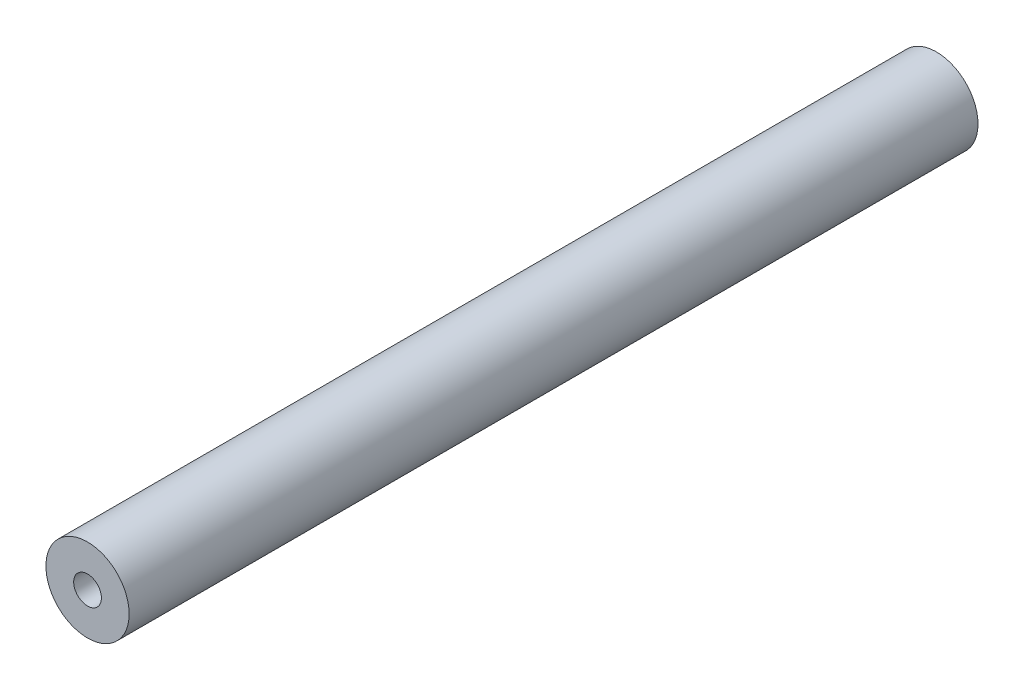
ISO-10303-21;
HEADER;
FILE_DESCRIPTION(('STEP AP214'),'2;1');
FILE_NAME('part.step','',(''),(''),'','','');
FILE_SCHEMA(('AUTOMOTIVE_DESIGN { 1 0 10303 214 1 1 1 1 }'));
ENDSEC;
DATA;
#1=APPLICATION_CONTEXT('core data for automotive mechanical design processes');
#2=APPLICATION_PROTOCOL_DEFINITION('international standard','automotive_design',2000,#1);
#3=PRODUCT_CONTEXT('',#1,'mechanical');
#4=PRODUCT('Part','Part','',(#3));
#5=PRODUCT_RELATED_PRODUCT_CATEGORY('part','',(#4));
#6=PRODUCT_DEFINITION_FORMATION('','',#4);
#7=PRODUCT_DEFINITION_CONTEXT('part definition',#1,'design');
#8=PRODUCT_DEFINITION('design','',#6,#7);
#9=PRODUCT_DEFINITION_SHAPE('','',#8);
#10=(LENGTH_UNIT() NAMED_UNIT(*) SI_UNIT(.MILLI.,.METRE.));
#11=(NAMED_UNIT(*) PLANE_ANGLE_UNIT() SI_UNIT($,.RADIAN.));
#12=(NAMED_UNIT(*) SI_UNIT($,.STERADIAN.) SOLID_ANGLE_UNIT());
#13=UNCERTAINTY_MEASURE_WITH_UNIT(LENGTH_MEASURE(1.E-05),#10,'distance_accuracy_value','');
#14=(GEOMETRIC_REPRESENTATION_CONTEXT(3) GLOBAL_UNCERTAINTY_ASSIGNED_CONTEXT((#13)) GLOBAL_UNIT_ASSIGNED_CONTEXT((#10,
#11,#12)) REPRESENTATION_CONTEXT('',''));
#15=CARTESIAN_POINT('',(0.,0.,0.));
#16=DIRECTION('',(0.,0.,1.));
#17=DIRECTION('',(1.,0.,0.));
#18=AXIS2_PLACEMENT_3D('',#15,#16,#17);
#19=CARTESIAN_POINT('',(0.,0.,777.24));
#20=DIRECTION('',(0.,0.,1.));
#21=DIRECTION('',(1.,0.,0.));
#22=AXIS2_PLACEMENT_3D('',#19,#20,#21);
#23=PLANE('',#22);
#24=CARTESIAN_POINT('',(0.,0.,777.24));
#25=DIRECTION('',(0.,0.,1.));
#26=DIRECTION('',(1.,0.,0.));
#27=AXIS2_PLACEMENT_3D('',#24,#25,#26);
#28=CIRCLE('',#27,38.1);
#29=CARTESIAN_POINT('',(38.1,0.,777.24));
#30=VERTEX_POINT('',#29);
#31=EDGE_CURVE('E10',#30,#30,#28,.T.);
#32=ORIENTED_EDGE('',*,*,#31,.T.);
#33=EDGE_LOOP('',(#32));
#34=FACE_BOUND('',#33,.T.);
#35=CARTESIAN_POINT('',(0.,0.,777.24));
#36=DIRECTION('',(0.,0.,1.));
#37=DIRECTION('',(1.,0.,0.));
#38=AXIS2_PLACEMENT_3D('',#35,#36,#37);
#39=CIRCLE('',#38,12.7);
#40=CARTESIAN_POINT('',(12.7,0.,777.24));
#41=VERTEX_POINT('',#40);
#42=EDGE_CURVE('E54',#41,#41,#39,.T.);
#43=ORIENTED_EDGE('',*,*,#42,.F.);
#44=EDGE_LOOP('',(#43));
#45=FACE_BOUND('',#44,.T.);
#46=ADVANCED_FACE('F41',(#34,#45),#23,.T.);
#47=CARTESIAN_POINT('',(0.,0.,0.));
#48=DIRECTION('',(0.,0.,1.));
#49=DIRECTION('',(1.,0.,0.));
#50=AXIS2_PLACEMENT_3D('',#47,#48,#49);
#51=PLANE('',#50);
#52=CARTESIAN_POINT('',(0.,0.,0.));
#53=DIRECTION('',(0.,0.,1.));
#54=DIRECTION('',(1.,0.,0.));
#55=AXIS2_PLACEMENT_3D('',#52,#53,#54);
#56=CIRCLE('',#55,38.1);
#57=CARTESIAN_POINT('',(38.1,0.,0.));
#58=VERTEX_POINT('',#57);
#59=EDGE_CURVE('E45',#58,#58,#56,.T.);
#60=ORIENTED_EDGE('',*,*,#59,.F.);
#61=EDGE_LOOP('',(#60));
#62=FACE_BOUND('',#61,.T.);
#63=CARTESIAN_POINT('',(0.,0.,0.));
#64=DIRECTION('',(0.,0.,1.));
#65=DIRECTION('',(1.,0.,0.));
#66=AXIS2_PLACEMENT_3D('',#63,#64,#65);
#67=CIRCLE('',#66,12.7);
#68=CARTESIAN_POINT('',(12.7,0.,0.));
#69=VERTEX_POINT('',#68);
#70=EDGE_CURVE('E56',#69,#69,#67,.T.);
#71=ORIENTED_EDGE('',*,*,#70,.T.);
#72=EDGE_LOOP('',(#71));
#73=FACE_BOUND('',#72,.T.);
#74=ADVANCED_FACE('F68',(#62,#73),#51,.F.);
#75=CARTESIAN_POINT('',(0.,0.,777.24));
#76=DIRECTION('',(0.,0.,-1.));
#77=DIRECTION('',(-1.,0.,0.));
#78=AXIS2_PLACEMENT_3D('',#75,#76,#77);
#79=CYLINDRICAL_SURFACE('',#78,38.1);
#80=ORIENTED_EDGE('',*,*,#31,.F.);
#81=EDGE_LOOP('',(#80));
#82=FACE_BOUND('',#81,.T.);
#83=ORIENTED_EDGE('',*,*,#59,.T.);
#84=EDGE_LOOP('',(#83));
#85=FACE_BOUND('',#84,.T.);
#86=ADVANCED_FACE('F43',(#82,#85),#79,.T.);
#87=CARTESIAN_POINT('',(0.,0.,777.24));
#88=DIRECTION('',(0.,0.,-1.));
#89=DIRECTION('',(-1.,0.,0.));
#90=AXIS2_PLACEMENT_3D('',#87,#88,#89);
#91=CYLINDRICAL_SURFACE('',#90,12.7);
#92=ORIENTED_EDGE('',*,*,#42,.T.);
#93=EDGE_LOOP('',(#92));
#94=FACE_BOUND('',#93,.T.);
#95=ORIENTED_EDGE('',*,*,#70,.F.);
#96=EDGE_LOOP('',(#95));
#97=FACE_BOUND('',#96,.T.);
#98=ADVANCED_FACE('F64',(#94,#97),#91,.F.);
#99=CLOSED_SHELL('',(#46,#74,#86,#98));
#100=MANIFOLD_SOLID_BREP('B2',#99);
#101=ADVANCED_BREP_SHAPE_REPRESENTATION('',(#18,#100),#14);
#102=SHAPE_DEFINITION_REPRESENTATION(#9,#101);
ENDSEC;
END-ISO-10303-21;
